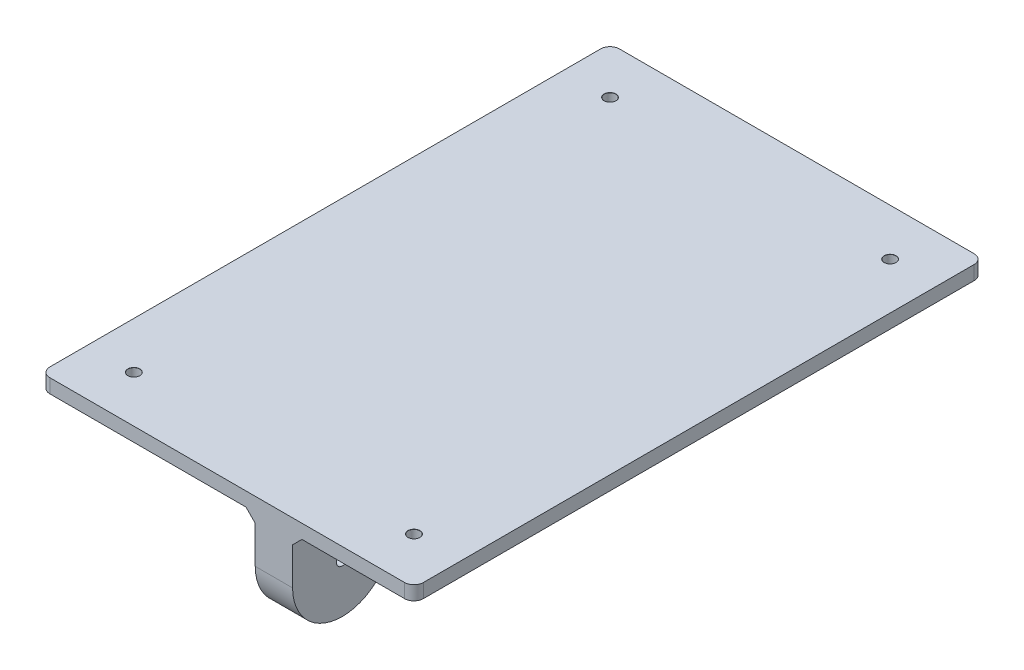
ISO-10303-21;
HEADER;
FILE_DESCRIPTION(('STEP AP214'),'2;1');
FILE_NAME('part.step','',(''),(''),'','','');
FILE_SCHEMA(('AUTOMOTIVE_DESIGN { 1 0 10303 214 1 1 1 1 }'));
ENDSEC;
DATA;
#1=APPLICATION_CONTEXT('core data for automotive mechanical design processes');
#2=APPLICATION_PROTOCOL_DEFINITION('international standard','automotive_design',2000,#1);
#3=PRODUCT_CONTEXT('',#1,'mechanical');
#4=PRODUCT('Part','Part','',(#3));
#5=PRODUCT_RELATED_PRODUCT_CATEGORY('part','',(#4));
#6=PRODUCT_DEFINITION_FORMATION('','',#4);
#7=PRODUCT_DEFINITION_CONTEXT('part definition',#1,'design');
#8=PRODUCT_DEFINITION('design','',#6,#7);
#9=PRODUCT_DEFINITION_SHAPE('','',#8);
#10=(LENGTH_UNIT() NAMED_UNIT(*) SI_UNIT(.MILLI.,.METRE.));
#11=(NAMED_UNIT(*) PLANE_ANGLE_UNIT() SI_UNIT($,.RADIAN.));
#12=(NAMED_UNIT(*) SI_UNIT($,.STERADIAN.) SOLID_ANGLE_UNIT());
#13=UNCERTAINTY_MEASURE_WITH_UNIT(LENGTH_MEASURE(1.E-05),#10,'distance_accuracy_value','');
#14=(GEOMETRIC_REPRESENTATION_CONTEXT(3) GLOBAL_UNCERTAINTY_ASSIGNED_CONTEXT((#13)) GLOBAL_UNIT_ASSIGNED_CONTEXT((#10,
#11,#12)) REPRESENTATION_CONTEXT('',''));
#15=CARTESIAN_POINT('',(0.,0.,0.));
#16=DIRECTION('',(0.,0.,1.));
#17=DIRECTION('',(1.,0.,0.));
#18=AXIS2_PLACEMENT_3D('',#15,#16,#17);
#19=CARTESIAN_POINT('',(0.,0.,0.));
#20=DIRECTION('',(0.,-1.,0.));
#21=DIRECTION('',(0.,0.,-1.));
#22=AXIS2_PLACEMENT_3D('',#19,#20,#21);
#23=PLANE('',#22);
#24=CARTESIAN_POINT('',(-30.,0.,-51.));
#25=DIRECTION('',(0.,-1.,0.));
#26=DIRECTION('',(0.,0.,-1.));
#27=AXIS2_PLACEMENT_3D('',#24,#25,#26);
#28=CIRCLE('',#27,1.24999999999999);
#29=CARTESIAN_POINT('',(-30.,0.,-52.25));
#30=VERTEX_POINT('',#29);
#31=EDGE_CURVE('E414',#30,#30,#28,.T.);
#32=ORIENTED_EDGE('',*,*,#31,.F.);
#33=EDGE_LOOP('',(#32));
#34=FACE_BOUND('',#33,.T.);
#35=CARTESIAN_POINT('',(-30.,0.,51.));
#36=DIRECTION('',(0.,-1.,0.));
#37=DIRECTION('',(0.,0.,-1.));
#38=AXIS2_PLACEMENT_3D('',#35,#36,#37);
#39=CIRCLE('',#38,1.24999999999999);
#40=CARTESIAN_POINT('',(-30.,0.,49.75));
#41=VERTEX_POINT('',#40);
#42=EDGE_CURVE('E408',#41,#41,#39,.T.);
#43=ORIENTED_EDGE('',*,*,#42,.F.);
#44=EDGE_LOOP('',(#43));
#45=FACE_BOUND('',#44,.T.);
#46=CARTESIAN_POINT('',(30.,0.,51.));
#47=DIRECTION('',(0.,-1.,0.));
#48=DIRECTION('',(0.,0.,-1.));
#49=AXIS2_PLACEMENT_3D('',#46,#47,#48);
#50=CIRCLE('',#49,1.24999999999999);
#51=CARTESIAN_POINT('',(30.,0.,49.75));
#52=VERTEX_POINT('',#51);
#53=EDGE_CURVE('E402',#52,#52,#50,.T.);
#54=ORIENTED_EDGE('',*,*,#53,.F.);
#55=EDGE_LOOP('',(#54));
#56=FACE_BOUND('',#55,.T.);
#57=CARTESIAN_POINT('',(30.,0.,-51.));
#58=DIRECTION('',(0.,-1.,0.));
#59=DIRECTION('',(0.,0.,-1.));
#60=AXIS2_PLACEMENT_3D('',#57,#58,#59);
#61=CIRCLE('',#60,1.24999999999999);
#62=CARTESIAN_POINT('',(30.,0.,-52.25));
#63=VERTEX_POINT('',#62);
#64=EDGE_CURVE('E349',#63,#63,#61,.T.);
#65=ORIENTED_EDGE('',*,*,#64,.F.);
#66=EDGE_LOOP('',(#65));
#67=FACE_BOUND('',#66,.T.);
#68=DIRECTION('',(-1.,0.,0.));
#69=VECTOR('',#68,1.);
#70=CARTESIAN_POINT('',(-40.,0.,-61.));
#71=LINE('',#70,#69);
#72=CARTESIAN_POINT('',(38.,0.,-61.));
#73=VERTEX_POINT('',#72);
#74=CARTESIAN_POINT('',(16.,0.,-61.));
#75=VERTEX_POINT('',#74);
#76=EDGE_CURVE('E276',#73,#75,#71,.T.);
#77=ORIENTED_EDGE('',*,*,#76,.F.);
#78=CARTESIAN_POINT('',(38.,0.,-59.));
#79=DIRECTION('',(0.,-1.,0.));
#80=DIRECTION('',(0.,0.,-1.));
#81=AXIS2_PLACEMENT_3D('',#78,#79,#80);
#82=CIRCLE('',#81,2.);
#83=CARTESIAN_POINT('',(40.,0.,-59.));
#84=VERTEX_POINT('',#83);
#85=EDGE_CURVE('E368',#73,#84,#82,.T.);
#86=ORIENTED_EDGE('',*,*,#85,.T.);
#87=DIRECTION('',(0.,0.,-1.));
#88=VECTOR('',#87,1.);
#89=CARTESIAN_POINT('',(40.,0.,61.));
#90=LINE('',#89,#88);
#91=CARTESIAN_POINT('',(40.,0.,59.));
#92=VERTEX_POINT('',#91);
#93=EDGE_CURVE('E255',#92,#84,#90,.T.);
#94=ORIENTED_EDGE('',*,*,#93,.F.);
#95=CARTESIAN_POINT('',(38.,0.,59.));
#96=DIRECTION('',(0.,-1.,0.));
#97=DIRECTION('',(0.,0.,-1.));
#98=AXIS2_PLACEMENT_3D('',#95,#96,#97);
#99=CIRCLE('',#98,2.);
#100=CARTESIAN_POINT('',(38.,0.,61.));
#101=VERTEX_POINT('',#100);
#102=EDGE_CURVE('E365',#92,#101,#99,.T.);
#103=ORIENTED_EDGE('',*,*,#102,.T.);
#104=DIRECTION('',(1.,0.,0.));
#105=VECTOR('',#104,1.);
#106=CARTESIAN_POINT('',(-40.,0.,61.));
#107=LINE('',#106,#105);
#108=CARTESIAN_POINT('',(16.,0.,61.));
#109=VERTEX_POINT('',#108);
#110=EDGE_CURVE('E283',#109,#101,#107,.T.);
#111=ORIENTED_EDGE('',*,*,#110,.F.);
#112=DIRECTION('',(0.,0.,-1.));
#113=VECTOR('',#112,1.);
#114=CARTESIAN_POINT('',(16.,0.,39.72));
#115=LINE('',#114,#113);
#116=CARTESIAN_POINT('',(16.,0.,37.72));
#117=VERTEX_POINT('',#116);
#118=EDGE_CURVE('E296',#109,#117,#115,.T.);
#119=ORIENTED_EDGE('',*,*,#118,.T.);
#120=DIRECTION('',(-1.,0.,0.));
#121=VECTOR('',#120,1.);
#122=CARTESIAN_POINT('',(0.,0.,37.72));
#123=LINE('',#122,#121);
#124=CARTESIAN_POINT('',(4.00000000000001,0.,37.72));
#125=VERTEX_POINT('',#124);
#126=EDGE_CURVE('E299',#117,#125,#123,.T.);
#127=ORIENTED_EDGE('',*,*,#126,.T.);
#128=DIRECTION('',(0.,0.,1.));
#129=VECTOR('',#128,1.);
#130=CARTESIAN_POINT('',(4.00000000000001,0.,0.));
#131=LINE('',#130,#129);
#132=CARTESIAN_POINT('',(4.00000000000001,0.,61.));
#133=VERTEX_POINT('',#132);
#134=EDGE_CURVE('E302',#125,#133,#131,.T.);
#135=ORIENTED_EDGE('',*,*,#134,.T.);
#136=CARTESIAN_POINT('',(-38.,0.,61.));
#137=VERTEX_POINT('',#136);
#138=EDGE_CURVE('E261',#137,#133,#107,.T.);
#139=ORIENTED_EDGE('',*,*,#138,.F.);
#140=CARTESIAN_POINT('',(-38.,0.,59.));
#141=DIRECTION('',(0.,-1.,0.));
#142=DIRECTION('',(0.,0.,-1.));
#143=AXIS2_PLACEMENT_3D('',#140,#141,#142);
#144=CIRCLE('',#143,2.);
#145=CARTESIAN_POINT('',(-40.,0.,59.));
#146=VERTEX_POINT('',#145);
#147=EDGE_CURVE('E362',#137,#146,#144,.T.);
#148=ORIENTED_EDGE('',*,*,#147,.T.);
#149=DIRECTION('',(0.,0.,1.));
#150=VECTOR('',#149,1.);
#151=CARTESIAN_POINT('',(-40.,0.,61.));
#152=LINE('',#151,#150);
#153=CARTESIAN_POINT('',(-40.,0.,-59.));
#154=VERTEX_POINT('',#153);
#155=EDGE_CURVE('E279',#154,#146,#152,.T.);
#156=ORIENTED_EDGE('',*,*,#155,.F.);
#157=CARTESIAN_POINT('',(-38.,0.,-59.));
#158=DIRECTION('',(0.,-1.,0.));
#159=DIRECTION('',(0.,0.,-1.));
#160=AXIS2_PLACEMENT_3D('',#157,#158,#159);
#161=CIRCLE('',#160,2.);
#162=CARTESIAN_POINT('',(-38.,0.,-61.));
#163=VERTEX_POINT('',#162);
#164=EDGE_CURVE('E359',#154,#163,#161,.T.);
#165=ORIENTED_EDGE('',*,*,#164,.T.);
#166=CARTESIAN_POINT('',(4.,0.,-61.));
#167=VERTEX_POINT('',#166);
#168=EDGE_CURVE('E275',#167,#163,#71,.T.);
#169=ORIENTED_EDGE('',*,*,#168,.F.);
#170=DIRECTION('',(0.,0.,1.));
#171=VECTOR('',#170,1.);
#172=CARTESIAN_POINT('',(4.,0.,0.));
#173=LINE('',#172,#171);
#174=CARTESIAN_POINT('',(4.,0.,-37.72));
#175=VERTEX_POINT('',#174);
#176=EDGE_CURVE('E292',#167,#175,#173,.T.);
#177=ORIENTED_EDGE('',*,*,#176,.T.);
#178=DIRECTION('',(1.,0.,0.));
#179=VECTOR('',#178,1.);
#180=CARTESIAN_POINT('',(0.,0.,-37.72));
#181=LINE('',#180,#179);
#182=CARTESIAN_POINT('',(16.,0.,-37.72));
#183=VERTEX_POINT('',#182);
#184=EDGE_CURVE('E289',#175,#183,#181,.T.);
#185=ORIENTED_EDGE('',*,*,#184,.T.);
#186=DIRECTION('',(0.,0.,-1.));
#187=VECTOR('',#186,1.);
#188=CARTESIAN_POINT('',(16.,0.,-61.));
#189=LINE('',#188,#187);
#190=EDGE_CURVE('E271',#183,#75,#189,.T.);
#191=ORIENTED_EDGE('',*,*,#190,.T.);
#192=EDGE_LOOP('',(#77,#86,#94,#103,#111,#119,#127,#135,#139,#148,#156,#165,#169,#177,#185,#191));
#193=FACE_BOUND('',#192,.T.);
#194=ADVANCED_FACE('F44',(#34,#45,#56,#67,#193),#23,.T.);
#195=CARTESIAN_POINT('',(40.,3.,61.));
#196=DIRECTION('',(-1.,0.,0.));
#197=DIRECTION('',(0.,0.,1.));
#198=AXIS2_PLACEMENT_3D('',#195,#196,#197);
#199=PLANE('',#198);
#200=ORIENTED_EDGE('',*,*,#93,.T.);
#201=DIRECTION('',(0.,-1.,0.));
#202=VECTOR('',#201,1.);
#203=CARTESIAN_POINT('',(40.,3.,-59.));
#204=LINE('',#203,#202);
#205=CARTESIAN_POINT('',(40.,3.,-59.));
#206=VERTEX_POINT('',#205);
#207=EDGE_CURVE('E375',#84,#206,#204,.F.);
#208=ORIENTED_EDGE('',*,*,#207,.T.);
#209=DIRECTION('',(0.,0.,-1.));
#210=VECTOR('',#209,1.);
#211=CARTESIAN_POINT('',(40.,3.,61.));
#212=LINE('',#211,#210);
#213=CARTESIAN_POINT('',(40.,3.,59.));
#214=VERTEX_POINT('',#213);
#215=EDGE_CURVE('E256',#214,#206,#212,.T.);
#216=ORIENTED_EDGE('',*,*,#215,.F.);
#217=DIRECTION('',(0.,-1.,0.));
#218=VECTOR('',#217,1.);
#219=CARTESIAN_POINT('',(40.,3.,59.));
#220=LINE('',#219,#218);
#221=EDGE_CURVE('E371',#214,#92,#220,.T.);
#222=ORIENTED_EDGE('',*,*,#221,.T.);
#223=EDGE_LOOP('',(#200,#208,#216,#222));
#224=FACE_BOUND('',#223,.T.);
#225=ADVANCED_FACE('F550',(#224),#199,.F.);
#226=CARTESIAN_POINT('',(-40.,3.,-61.));
#227=DIRECTION('',(0.,0.,1.));
#228=DIRECTION('',(1.,0.,0.));
#229=AXIS2_PLACEMENT_3D('',#226,#227,#228);
#230=PLANE('',#229);
#231=DIRECTION('',(-1.,0.,0.));
#232=VECTOR('',#231,1.);
#233=CARTESIAN_POINT('',(-40.,3.,-61.));
#234=LINE('',#233,#232);
#235=CARTESIAN_POINT('',(38.,3.,-61.));
#236=VERTEX_POINT('',#235);
#237=CARTESIAN_POINT('',(-38.,3.,-61.));
#238=VERTEX_POINT('',#237);
#239=EDGE_CURVE('E260',#236,#238,#234,.T.);
#240=ORIENTED_EDGE('',*,*,#239,.F.);
#241=DIRECTION('',(0.,-1.,0.));
#242=VECTOR('',#241,1.);
#243=CARTESIAN_POINT('',(38.,3.,-61.));
#244=LINE('',#243,#242);
#245=EDGE_CURVE('E355',#236,#73,#244,.T.);
#246=ORIENTED_EDGE('',*,*,#245,.T.);
#247=ORIENTED_EDGE('',*,*,#76,.T.);
#248=DIRECTION('',(0.707106781186545,0.70710678118655,0.));
#249=VECTOR('',#248,1.);
#250=CARTESIAN_POINT('',(-10.4999999999998,-26.5,-61.));
#251=LINE('',#250,#249);
#252=CARTESIAN_POINT('',(14.,-2.00000000000002,-61.));
#253=VERTEX_POINT('',#252);
#254=EDGE_CURVE('E332',#75,#253,#251,.F.);
#255=ORIENTED_EDGE('',*,*,#254,.T.);
#256=DIRECTION('',(0.,1.,0.));
#257=VECTOR('',#256,1.);
#258=CARTESIAN_POINT('',(14.,0.,-61.));
#259=LINE('',#258,#257);
#260=CARTESIAN_POINT('',(14.,-10.,-61.));
#261=VERTEX_POINT('',#260);
#262=EDGE_CURVE('E207',#261,#253,#259,.T.);
#263=ORIENTED_EDGE('',*,*,#262,.F.);
#264=DIRECTION('',(-1.,0.,0.));
#265=VECTOR('',#264,1.);
#266=CARTESIAN_POINT('',(14.,-10.,-61.));
#267=LINE('',#266,#265);
#268=CARTESIAN_POINT('',(6.,-10.,-61.));
#269=VERTEX_POINT('',#268);
#270=EDGE_CURVE('E190',#261,#269,#267,.T.);
#271=ORIENTED_EDGE('',*,*,#270,.T.);
#272=DIRECTION('',(0.,1.,0.));
#273=VECTOR('',#272,1.);
#274=CARTESIAN_POINT('',(6.,0.,-61.));
#275=LINE('',#274,#273);
#276=CARTESIAN_POINT('',(6.,-2.00000000000002,-61.));
#277=VERTEX_POINT('',#276);
#278=EDGE_CURVE('E199',#269,#277,#275,.T.);
#279=ORIENTED_EDGE('',*,*,#278,.T.);
#280=DIRECTION('',(-0.707106781186545,0.70710678118655,0.));
#281=VECTOR('',#280,1.);
#282=CARTESIAN_POINT('',(-19.4999999999999,23.5,-61.));
#283=LINE('',#282,#281);
#284=EDGE_CURVE('E329',#277,#167,#283,.T.);
#285=ORIENTED_EDGE('',*,*,#284,.T.);
#286=ORIENTED_EDGE('',*,*,#168,.T.);
#287=DIRECTION('',(0.,-1.,0.));
#288=VECTOR('',#287,1.);
#289=CARTESIAN_POINT('',(-38.,3.,-61.));
#290=LINE('',#289,#288);
#291=EDGE_CURVE('E335',#163,#238,#290,.F.);
#292=ORIENTED_EDGE('',*,*,#291,.T.);
#293=EDGE_LOOP('',(#240,#246,#247,#255,#263,#271,#279,#285,#286,#292));
#294=FACE_BOUND('',#293,.T.);
#295=ADVANCED_FACE('F204',(#294),#230,.F.);
#296=CARTESIAN_POINT('',(-40.,3.,61.));
#297=DIRECTION('',(1.,0.,0.));
#298=DIRECTION('',(0.,0.,-1.));
#299=AXIS2_PLACEMENT_3D('',#296,#297,#298);
#300=PLANE('',#299);
#301=ORIENTED_EDGE('',*,*,#155,.T.);
#302=DIRECTION('',(0.,-1.,0.));
#303=VECTOR('',#302,1.);
#304=CARTESIAN_POINT('',(-40.,3.,59.));
#305=LINE('',#304,#303);
#306=CARTESIAN_POINT('',(-40.,3.,59.));
#307=VERTEX_POINT('',#306);
#308=EDGE_CURVE('E11',#146,#307,#305,.F.);
#309=ORIENTED_EDGE('',*,*,#308,.T.);
#310=DIRECTION('',(0.,0.,1.));
#311=VECTOR('',#310,1.);
#312=CARTESIAN_POINT('',(-40.,3.,61.));
#313=LINE('',#312,#311);
#314=CARTESIAN_POINT('',(-40.,3.,-59.));
#315=VERTEX_POINT('',#314);
#316=EDGE_CURVE('E265',#315,#307,#313,.T.);
#317=ORIENTED_EDGE('',*,*,#316,.F.);
#318=DIRECTION('',(0.,-1.,0.));
#319=VECTOR('',#318,1.);
#320=CARTESIAN_POINT('',(-40.,3.,-59.));
#321=LINE('',#320,#319);
#322=EDGE_CURVE('E54',#315,#154,#321,.T.);
#323=ORIENTED_EDGE('',*,*,#322,.T.);
#324=EDGE_LOOP('',(#301,#309,#317,#323));
#325=FACE_BOUND('',#324,.T.);
#326=ADVANCED_FACE('F537',(#325),#300,.F.);
#327=CARTESIAN_POINT('',(-40.,3.,61.));
#328=DIRECTION('',(0.,0.,-1.));
#329=DIRECTION('',(-1.,0.,0.));
#330=AXIS2_PLACEMENT_3D('',#327,#328,#329);
#331=PLANE('',#330);
#332=ORIENTED_EDGE('',*,*,#110,.T.);
#333=DIRECTION('',(0.,-1.,0.));
#334=VECTOR('',#333,1.);
#335=CARTESIAN_POINT('',(38.,3.,61.));
#336=LINE('',#335,#334);
#337=CARTESIAN_POINT('',(38.,3.,61.));
#338=VERTEX_POINT('',#337);
#339=EDGE_CURVE('E62',#101,#338,#336,.F.);
#340=ORIENTED_EDGE('',*,*,#339,.T.);
#341=DIRECTION('',(1.,0.,0.));
#342=VECTOR('',#341,1.);
#343=CARTESIAN_POINT('',(-40.,3.,61.));
#344=LINE('',#343,#342);
#345=CARTESIAN_POINT('',(-38.,3.,61.));
#346=VERTEX_POINT('',#345);
#347=EDGE_CURVE('E268',#346,#338,#344,.T.);
#348=ORIENTED_EDGE('',*,*,#347,.F.);
#349=DIRECTION('',(0.,-1.,0.));
#350=VECTOR('',#349,1.);
#351=CARTESIAN_POINT('',(-38.,3.,61.));
#352=LINE('',#351,#350);
#353=EDGE_CURVE('E389',#346,#137,#352,.T.);
#354=ORIENTED_EDGE('',*,*,#353,.T.);
#355=ORIENTED_EDGE('',*,*,#138,.T.);
#356=DIRECTION('',(0.707106781186545,-0.70710678118655,0.));
#357=VECTOR('',#356,1.);
#358=CARTESIAN_POINT('',(-19.4999999999998,23.5,61.));
#359=LINE('',#358,#357);
#360=CARTESIAN_POINT('',(6.,-2.,61.));
#361=VERTEX_POINT('',#360);
#362=EDGE_CURVE('E323',#133,#361,#359,.T.);
#363=ORIENTED_EDGE('',*,*,#362,.T.);
#364=DIRECTION('',(0.,-1.,0.));
#365=VECTOR('',#364,1.);
#366=CARTESIAN_POINT('',(6.,0.,61.));
#367=LINE('',#366,#365);
#368=CARTESIAN_POINT('',(6.,-10.,61.));
#369=VERTEX_POINT('',#368);
#370=EDGE_CURVE('E223',#361,#369,#367,.T.);
#371=ORIENTED_EDGE('',*,*,#370,.T.);
#372=DIRECTION('',(-1.,0.,0.));
#373=VECTOR('',#372,1.);
#374=CARTESIAN_POINT('',(14.,-10.,61.));
#375=LINE('',#374,#373);
#376=CARTESIAN_POINT('',(14.,-10.,61.));
#377=VERTEX_POINT('',#376);
#378=EDGE_CURVE('E251',#377,#369,#375,.T.);
#379=ORIENTED_EDGE('',*,*,#378,.F.);
#380=DIRECTION('',(0.,-1.,0.));
#381=VECTOR('',#380,1.);
#382=CARTESIAN_POINT('',(14.,0.,61.));
#383=LINE('',#382,#381);
#384=CARTESIAN_POINT('',(14.,-2.,61.));
#385=VERTEX_POINT('',#384);
#386=EDGE_CURVE('E228',#385,#377,#383,.T.);
#387=ORIENTED_EDGE('',*,*,#386,.F.);
#388=DIRECTION('',(-0.707106781186545,-0.70710678118655,0.));
#389=VECTOR('',#388,1.);
#390=CARTESIAN_POINT('',(-10.4999999999998,-26.5,61.));
#391=LINE('',#390,#389);
#392=EDGE_CURVE('E326',#385,#109,#391,.F.);
#393=ORIENTED_EDGE('',*,*,#392,.T.);
#394=EDGE_LOOP('',(#332,#340,#348,#354,#355,#363,#371,#379,#387,#393));
#395=FACE_BOUND('',#394,.T.);
#396=ADVANCED_FACE('F521',(#395),#331,.F.);
#397=CARTESIAN_POINT('',(0.,3.,0.));
#398=DIRECTION('',(0.,-1.,0.));
#399=DIRECTION('',(0.,0.,-1.));
#400=AXIS2_PLACEMENT_3D('',#397,#398,#399);
#401=PLANE('',#400);
#402=CARTESIAN_POINT('',(-30.,3.,-51.));
#403=DIRECTION('',(0.,1.,0.));
#404=DIRECTION('',(0.,0.,1.));
#405=AXIS2_PLACEMENT_3D('',#402,#403,#404);
#406=CIRCLE('',#405,1.275);
#407=CARTESIAN_POINT('',(-30.,3.,-49.725));
#408=VERTEX_POINT('',#407);
#409=EDGE_CURVE('E422',#408,#408,#406,.T.);
#410=ORIENTED_EDGE('',*,*,#409,.F.);
#411=EDGE_LOOP('',(#410));
#412=FACE_BOUND('',#411,.T.);
#413=CARTESIAN_POINT('',(-30.,3.,51.));
#414=DIRECTION('',(0.,1.,0.));
#415=DIRECTION('',(0.,0.,1.));
#416=AXIS2_PLACEMENT_3D('',#413,#414,#415);
#417=CIRCLE('',#416,1.275);
#418=CARTESIAN_POINT('',(-30.,3.,52.275));
#419=VERTEX_POINT('',#418);
#420=EDGE_CURVE('E417',#419,#419,#417,.T.);
#421=ORIENTED_EDGE('',*,*,#420,.F.);
#422=EDGE_LOOP('',(#421));
#423=FACE_BOUND('',#422,.T.);
#424=CARTESIAN_POINT('',(30.,3.,51.));
#425=DIRECTION('',(0.,1.,0.));
#426=DIRECTION('',(0.,0.,1.));
#427=AXIS2_PLACEMENT_3D('',#424,#425,#426);
#428=CIRCLE('',#427,1.275);
#429=CARTESIAN_POINT('',(30.,3.,52.275));
#430=VERTEX_POINT('',#429);
#431=EDGE_CURVE('E412',#430,#430,#428,.T.);
#432=ORIENTED_EDGE('',*,*,#431,.F.);
#433=EDGE_LOOP('',(#432));
#434=FACE_BOUND('',#433,.T.);
#435=CARTESIAN_POINT('',(30.,3.,-51.));
#436=DIRECTION('',(0.,1.,0.));
#437=DIRECTION('',(0.,0.,1.));
#438=AXIS2_PLACEMENT_3D('',#435,#436,#437);
#439=CIRCLE('',#438,1.275);
#440=CARTESIAN_POINT('',(30.,3.,-49.725));
#441=VERTEX_POINT('',#440);
#442=EDGE_CURVE('E406',#441,#441,#439,.T.);
#443=ORIENTED_EDGE('',*,*,#442,.F.);
#444=EDGE_LOOP('',(#443));
#445=FACE_BOUND('',#444,.T.);
#446=ORIENTED_EDGE('',*,*,#215,.T.);
#447=CARTESIAN_POINT('',(38.,3.,-59.));
#448=DIRECTION('',(0.,-1.,0.));
#449=DIRECTION('',(0.,0.,-1.));
#450=AXIS2_PLACEMENT_3D('',#447,#448,#449);
#451=CIRCLE('',#450,2.);
#452=EDGE_CURVE('E386',#206,#236,#451,.F.);
#453=ORIENTED_EDGE('',*,*,#452,.T.);
#454=ORIENTED_EDGE('',*,*,#239,.T.);
#455=CARTESIAN_POINT('',(-38.,3.,-59.));
#456=DIRECTION('',(0.,-1.,0.));
#457=DIRECTION('',(0.,0.,-1.));
#458=AXIS2_PLACEMENT_3D('',#455,#456,#457);
#459=CIRCLE('',#458,2.);
#460=EDGE_CURVE('E378',#238,#315,#459,.F.);
#461=ORIENTED_EDGE('',*,*,#460,.T.);
#462=ORIENTED_EDGE('',*,*,#316,.T.);
#463=CARTESIAN_POINT('',(-38.,3.,59.));
#464=DIRECTION('',(0.,-1.,0.));
#465=DIRECTION('',(0.,0.,-1.));
#466=AXIS2_PLACEMENT_3D('',#463,#464,#465);
#467=CIRCLE('',#466,2.);
#468=EDGE_CURVE('E69',#307,#346,#467,.F.);
#469=ORIENTED_EDGE('',*,*,#468,.T.);
#470=ORIENTED_EDGE('',*,*,#347,.T.);
#471=CARTESIAN_POINT('',(38.,3.,59.));
#472=DIRECTION('',(0.,-1.,0.));
#473=DIRECTION('',(0.,0.,-1.));
#474=AXIS2_PLACEMENT_3D('',#471,#472,#473);
#475=CIRCLE('',#474,2.);
#476=EDGE_CURVE('E383',#338,#214,#475,.F.);
#477=ORIENTED_EDGE('',*,*,#476,.T.);
#478=EDGE_LOOP('',(#446,#453,#454,#461,#462,#469,#470,#477));
#479=FACE_BOUND('',#478,.T.);
#480=ADVANCED_FACE('F535',(#412,#423,#434,#445,#479),#401,.F.);
#481=CARTESIAN_POINT('',(14.,-10.,50.36));
#482=DIRECTION('',(-1.,0.,0.));
#483=DIRECTION('',(0.,0.,1.));
#484=AXIS2_PLACEMENT_3D('',#481,#482,#483);
#485=CYLINDRICAL_SURFACE('',#484,10.64);
#486=CARTESIAN_POINT('',(6.,-10.,50.36));
#487=DIRECTION('',(1.,0.,0.));
#488=DIRECTION('',(0.,0.,-1.));
#489=AXIS2_PLACEMENT_3D('',#486,#487,#488);
#490=CIRCLE('',#489,10.64);
#491=CARTESIAN_POINT('',(6.,-10.,39.72));
#492=VERTEX_POINT('',#491);
#493=EDGE_CURVE('E242',#369,#492,#490,.T.);
#494=ORIENTED_EDGE('',*,*,#493,.T.);
#495=DIRECTION('',(-1.,0.,0.));
#496=VECTOR('',#495,1.);
#497=CARTESIAN_POINT('',(14.,-10.,39.72));
#498=LINE('',#497,#496);
#499=CARTESIAN_POINT('',(14.,-10.,39.72));
#500=VERTEX_POINT('',#499);
#501=EDGE_CURVE('E239',#500,#492,#498,.T.);
#502=ORIENTED_EDGE('',*,*,#501,.F.);
#503=CARTESIAN_POINT('',(14.,-10.,50.36));
#504=DIRECTION('',(1.,0.,0.));
#505=DIRECTION('',(0.,0.,-1.));
#506=AXIS2_PLACEMENT_3D('',#503,#504,#505);
#507=CIRCLE('',#506,10.64);
#508=EDGE_CURVE('E231',#377,#500,#507,.T.);
#509=ORIENTED_EDGE('',*,*,#508,.F.);
#510=ORIENTED_EDGE('',*,*,#378,.T.);
#511=EDGE_LOOP('',(#494,#502,#509,#510));
#512=FACE_BOUND('',#511,.T.);
#513=ADVANCED_FACE('F670',(#512),#485,.T.);
#514=CARTESIAN_POINT('',(14.,0.,39.72));
#515=DIRECTION('',(0.,0.,1.));
#516=DIRECTION('',(1.,0.,0.));
#517=AXIS2_PLACEMENT_3D('',#514,#515,#516);
#518=PLANE('',#517);
#519=DIRECTION('',(0.,1.,0.));
#520=VECTOR('',#519,1.);
#521=CARTESIAN_POINT('',(6.,0.,39.72));
#522=LINE('',#521,#520);
#523=CARTESIAN_POINT('',(6.,-2.,39.72));
#524=VERTEX_POINT('',#523);
#525=EDGE_CURVE('E232',#492,#524,#522,.T.);
#526=ORIENTED_EDGE('',*,*,#525,.T.);
#527=DIRECTION('',(1.,0.,0.));
#528=VECTOR('',#527,1.);
#529=CARTESIAN_POINT('',(14.,-2.,39.72));
#530=LINE('',#529,#528);
#531=CARTESIAN_POINT('',(14.,-2.,39.72));
#532=VERTEX_POINT('',#531);
#533=EDGE_CURVE('E309',#524,#532,#530,.T.);
#534=ORIENTED_EDGE('',*,*,#533,.T.);
#535=DIRECTION('',(0.,1.,0.));
#536=VECTOR('',#535,1.);
#537=CARTESIAN_POINT('',(14.,0.,39.72));
#538=LINE('',#537,#536);
#539=EDGE_CURVE('E235',#500,#532,#538,.T.);
#540=ORIENTED_EDGE('',*,*,#539,.F.);
#541=ORIENTED_EDGE('',*,*,#501,.T.);
#542=EDGE_LOOP('',(#526,#534,#540,#541));
#543=FACE_BOUND('',#542,.T.);
#544=ADVANCED_FACE('F510',(#543),#518,.F.);
#545=CARTESIAN_POINT('',(14.,-10.,50.36));
#546=DIRECTION('',(1.,0.,0.));
#547=DIRECTION('',(0.,0.,-1.));
#548=AXIS2_PLACEMENT_3D('',#545,#546,#547);
#549=PLANE('',#548);
#550=CARTESIAN_POINT('',(14.,-10.,50.36));
#551=DIRECTION('',(1.,0.,0.));
#552=DIRECTION('',(0.,0.,-1.));
#553=AXIS2_PLACEMENT_3D('',#550,#551,#552);
#554=CIRCLE('',#553,1.24999999999999);
#555=CARTESIAN_POINT('',(14.,-10.,49.11));
#556=VERTEX_POINT('',#555);
#557=EDGE_CURVE('E419',#556,#556,#554,.T.);
#558=ORIENTED_EDGE('',*,*,#557,.F.);
#559=EDGE_LOOP('',(#558));
#560=FACE_BOUND('',#559,.T.);
#561=ORIENTED_EDGE('',*,*,#539,.T.);
#562=DIRECTION('',(0.,0.,1.));
#563=VECTOR('',#562,1.);
#564=CARTESIAN_POINT('',(14.,-2.,61.));
#565=LINE('',#564,#563);
#566=EDGE_CURVE('E312',#532,#385,#565,.T.);
#567=ORIENTED_EDGE('',*,*,#566,.T.);
#568=ORIENTED_EDGE('',*,*,#386,.T.);
#569=ORIENTED_EDGE('',*,*,#508,.T.);
#570=EDGE_LOOP('',(#561,#567,#568,#569));
#571=FACE_BOUND('',#570,.T.);
#572=ADVANCED_FACE('F491',(#560,#571),#549,.T.);
#573=CARTESIAN_POINT('',(6.,-10.,50.36));
#574=DIRECTION('',(1.,0.,0.));
#575=DIRECTION('',(0.,0.,-1.));
#576=AXIS2_PLACEMENT_3D('',#573,#574,#575);
#577=PLANE('',#576);
#578=CARTESIAN_POINT('',(6.,-10.,50.36));
#579=DIRECTION('',(-1.,0.,0.));
#580=DIRECTION('',(0.,0.,1.));
#581=AXIS2_PLACEMENT_3D('',#578,#579,#580);
#582=CIRCLE('',#581,6.45);
#583=CARTESIAN_POINT('',(6.,-10.,56.81));
#584=VERTEX_POINT('',#583);
#585=EDGE_CURVE('E469',#584,#584,#582,.T.);
#586=ORIENTED_EDGE('',*,*,#585,.F.);
#587=EDGE_LOOP('',(#586));
#588=FACE_BOUND('',#587,.T.);
#589=ORIENTED_EDGE('',*,*,#370,.F.);
#590=DIRECTION('',(0.,0.,-1.));
#591=VECTOR('',#590,1.);
#592=CARTESIAN_POINT('',(6.,-2.,50.36));
#593=LINE('',#592,#591);
#594=EDGE_CURVE('E306',#361,#524,#593,.T.);
#595=ORIENTED_EDGE('',*,*,#594,.T.);
#596=ORIENTED_EDGE('',*,*,#525,.F.);
#597=ORIENTED_EDGE('',*,*,#493,.F.);
#598=EDGE_LOOP('',(#589,#595,#596,#597));
#599=FACE_BOUND('',#598,.T.);
#600=ADVANCED_FACE('F487',(#588,#599),#577,.F.);
#601=CARTESIAN_POINT('',(14.,0.,-39.72));
#602=DIRECTION('',(0.,0.,-1.));
#603=DIRECTION('',(-1.,0.,0.));
#604=AXIS2_PLACEMENT_3D('',#601,#602,#603);
#605=PLANE('',#604);
#606=DIRECTION('',(0.,-1.,0.));
#607=VECTOR('',#606,1.);
#608=CARTESIAN_POINT('',(14.,0.,-39.72));
#609=LINE('',#608,#607);
#610=CARTESIAN_POINT('',(14.,-2.00000000000002,-39.72));
#611=VERTEX_POINT('',#610);
#612=CARTESIAN_POINT('',(14.,-10.,-39.72));
#613=VERTEX_POINT('',#612);
#614=EDGE_CURVE('E214',#611,#613,#609,.T.);
#615=ORIENTED_EDGE('',*,*,#614,.F.);
#616=DIRECTION('',(-1.,0.,0.));
#617=VECTOR('',#616,1.);
#618=CARTESIAN_POINT('',(14.,-2.00000000000002,-39.72));
#619=LINE('',#618,#617);
#620=CARTESIAN_POINT('',(6.,-2.00000000000002,-39.72));
#621=VERTEX_POINT('',#620);
#622=EDGE_CURVE('E317',#611,#621,#619,.T.);
#623=ORIENTED_EDGE('',*,*,#622,.T.);
#624=DIRECTION('',(0.,-1.,0.));
#625=VECTOR('',#624,1.);
#626=CARTESIAN_POINT('',(6.,0.,-39.72));
#627=LINE('',#626,#625);
#628=CARTESIAN_POINT('',(6.,-10.,-39.72));
#629=VERTEX_POINT('',#628);
#630=EDGE_CURVE('E198',#621,#629,#627,.T.);
#631=ORIENTED_EDGE('',*,*,#630,.T.);
#632=DIRECTION('',(-1.,0.,0.));
#633=VECTOR('',#632,1.);
#634=CARTESIAN_POINT('',(14.,-10.,-39.72));
#635=LINE('',#634,#633);
#636=EDGE_CURVE('E193',#613,#629,#635,.T.);
#637=ORIENTED_EDGE('',*,*,#636,.F.);
#638=EDGE_LOOP('',(#615,#623,#631,#637));
#639=FACE_BOUND('',#638,.T.);
#640=ADVANCED_FACE('F490',(#639),#605,.F.);
#641=CARTESIAN_POINT('',(14.,-10.,-50.36));
#642=DIRECTION('',(-1.,0.,0.));
#643=DIRECTION('',(0.,0.,1.));
#644=AXIS2_PLACEMENT_3D('',#641,#642,#643);
#645=CYLINDRICAL_SURFACE('',#644,10.64);
#646=CARTESIAN_POINT('',(6.,-10.,-50.36));
#647=DIRECTION('',(1.,0.,0.));
#648=DIRECTION('',(0.,0.,-1.));
#649=AXIS2_PLACEMENT_3D('',#646,#647,#648);
#650=CIRCLE('',#649,10.64);
#651=EDGE_CURVE('E186',#629,#269,#650,.T.);
#652=ORIENTED_EDGE('',*,*,#651,.T.);
#653=ORIENTED_EDGE('',*,*,#270,.F.);
#654=CARTESIAN_POINT('',(14.,-10.,-50.36));
#655=DIRECTION('',(1.,0.,0.));
#656=DIRECTION('',(0.,0.,-1.));
#657=AXIS2_PLACEMENT_3D('',#654,#655,#656);
#658=CIRCLE('',#657,10.64);
#659=EDGE_CURVE('E217',#613,#261,#658,.T.);
#660=ORIENTED_EDGE('',*,*,#659,.F.);
#661=ORIENTED_EDGE('',*,*,#636,.T.);
#662=EDGE_LOOP('',(#652,#653,#660,#661));
#663=FACE_BOUND('',#662,.T.);
#664=ADVANCED_FACE('F188',(#663),#645,.T.);
#665=CARTESIAN_POINT('',(14.,-10.,-50.36));
#666=DIRECTION('',(1.,0.,0.));
#667=DIRECTION('',(0.,0.,-1.));
#668=AXIS2_PLACEMENT_3D('',#665,#666,#667);
#669=PLANE('',#668);
#670=CARTESIAN_POINT('',(14.,-10.,-50.36));
#671=DIRECTION('',(1.,0.,0.));
#672=DIRECTION('',(0.,0.,-1.));
#673=AXIS2_PLACEMENT_3D('',#670,#671,#672);
#674=CIRCLE('',#673,1.24999999999999);
#675=CARTESIAN_POINT('',(14.,-10.,-51.61));
#676=VERTEX_POINT('',#675);
#677=EDGE_CURVE('E48',#676,#676,#674,.T.);
#678=ORIENTED_EDGE('',*,*,#677,.F.);
#679=EDGE_LOOP('',(#678));
#680=FACE_BOUND('',#679,.T.);
#681=ORIENTED_EDGE('',*,*,#262,.T.);
#682=DIRECTION('',(0.,0.,1.));
#683=VECTOR('',#682,1.);
#684=CARTESIAN_POINT('',(14.,-2.00000000000002,-39.72));
#685=LINE('',#684,#683);
#686=EDGE_CURVE('E320',#253,#611,#685,.T.);
#687=ORIENTED_EDGE('',*,*,#686,.T.);
#688=ORIENTED_EDGE('',*,*,#614,.T.);
#689=ORIENTED_EDGE('',*,*,#659,.T.);
#690=EDGE_LOOP('',(#681,#687,#688,#689));
#691=FACE_BOUND('',#690,.T.);
#692=ADVANCED_FACE('F566',(#680,#691),#669,.T.);
#693=CARTESIAN_POINT('',(6.,-10.,-50.36));
#694=DIRECTION('',(1.,0.,0.));
#695=DIRECTION('',(0.,0.,-1.));
#696=AXIS2_PLACEMENT_3D('',#693,#694,#695);
#697=PLANE('',#696);
#698=CARTESIAN_POINT('',(6.,-10.,-50.36));
#699=DIRECTION('',(-1.,0.,0.));
#700=DIRECTION('',(0.,0.,1.));
#701=AXIS2_PLACEMENT_3D('',#698,#699,#700);
#702=CIRCLE('',#701,6.45);
#703=CARTESIAN_POINT('',(6.,-10.,-43.91));
#704=VERTEX_POINT('',#703);
#705=EDGE_CURVE('E465',#704,#704,#702,.T.);
#706=ORIENTED_EDGE('',*,*,#705,.F.);
#707=EDGE_LOOP('',(#706));
#708=FACE_BOUND('',#707,.T.);
#709=ORIENTED_EDGE('',*,*,#630,.F.);
#710=DIRECTION('',(0.,0.,-1.));
#711=VECTOR('',#710,1.);
#712=CARTESIAN_POINT('',(6.,-2.00000000000002,-50.36));
#713=LINE('',#712,#711);
#714=EDGE_CURVE('E212',#621,#277,#713,.T.);
#715=ORIENTED_EDGE('',*,*,#714,.T.);
#716=ORIENTED_EDGE('',*,*,#278,.F.);
#717=ORIENTED_EDGE('',*,*,#651,.F.);
#718=EDGE_LOOP('',(#709,#715,#716,#717));
#719=FACE_BOUND('',#718,.T.);
#720=ADVANCED_FACE('F210',(#708,#719),#697,.F.);
#721=CARTESIAN_POINT('',(12.,-10.,-50.36));
#722=DIRECTION('',(-1.,0.,0.));
#723=DIRECTION('',(0.,0.,1.));
#724=AXIS2_PLACEMENT_3D('',#721,#722,#723);
#725=CYLINDRICAL_SURFACE('',#724,6.45);
#726=CARTESIAN_POINT('',(12.,-10.,-50.36));
#727=DIRECTION('',(-1.,0.,0.));
#728=DIRECTION('',(0.,0.,1.));
#729=AXIS2_PLACEMENT_3D('',#726,#727,#728);
#730=CIRCLE('',#729,6.45);
#731=CARTESIAN_POINT('',(12.,-10.,-43.91));
#732=VERTEX_POINT('',#731);
#733=EDGE_CURVE('E461',#732,#732,#730,.T.);
#734=ORIENTED_EDGE('',*,*,#733,.F.);
#735=EDGE_LOOP('',(#734));
#736=FACE_BOUND('',#735,.T.);
#737=ORIENTED_EDGE('',*,*,#705,.T.);
#738=EDGE_LOOP('',(#737));
#739=FACE_BOUND('',#738,.T.);
#740=ADVANCED_FACE('F648',(#736,#739),#725,.F.);
#741=CARTESIAN_POINT('',(12.,-10.,-50.36));
#742=DIRECTION('',(-1.,0.,0.));
#743=DIRECTION('',(0.,0.,1.));
#744=AXIS2_PLACEMENT_3D('',#741,#742,#743);
#745=PLANE('',#744);
#746=CARTESIAN_POINT('',(12.,-10.,-50.36));
#747=DIRECTION('',(-1.,0.,0.));
#748=DIRECTION('',(0.,0.,1.));
#749=AXIS2_PLACEMENT_3D('',#746,#747,#748);
#750=CIRCLE('',#749,1.275);
#751=CARTESIAN_POINT('',(12.,-10.,-49.085));
#752=VERTEX_POINT('',#751);
#753=EDGE_CURVE('E736',#752,#752,#750,.T.);
#754=ORIENTED_EDGE('',*,*,#753,.F.);
#755=EDGE_LOOP('',(#754));
#756=FACE_BOUND('',#755,.T.);
#757=ORIENTED_EDGE('',*,*,#733,.T.);
#758=EDGE_LOOP('',(#757));
#759=FACE_BOUND('',#758,.T.);
#760=ADVANCED_FACE('F483',(#756,#759),#745,.T.);
#761=CARTESIAN_POINT('',(12.,-10.,50.36));
#762=DIRECTION('',(-1.,0.,0.));
#763=DIRECTION('',(0.,0.,1.));
#764=AXIS2_PLACEMENT_3D('',#761,#762,#763);
#765=CYLINDRICAL_SURFACE('',#764,6.45);
#766=CARTESIAN_POINT('',(12.,-10.,50.36));
#767=DIRECTION('',(-1.,0.,0.));
#768=DIRECTION('',(0.,0.,1.));
#769=AXIS2_PLACEMENT_3D('',#766,#767,#768);
#770=CIRCLE('',#769,6.45);
#771=CARTESIAN_POINT('',(12.,-10.,56.81));
#772=VERTEX_POINT('',#771);
#773=EDGE_CURVE('E345',#772,#772,#770,.T.);
#774=ORIENTED_EDGE('',*,*,#773,.F.);
#775=EDGE_LOOP('',(#774));
#776=FACE_BOUND('',#775,.T.);
#777=ORIENTED_EDGE('',*,*,#585,.T.);
#778=EDGE_LOOP('',(#777));
#779=FACE_BOUND('',#778,.T.);
#780=ADVANCED_FACE('F480',(#776,#779),#765,.F.);
#781=CARTESIAN_POINT('',(12.,-10.,50.36));
#782=DIRECTION('',(-1.,0.,0.));
#783=DIRECTION('',(0.,0.,1.));
#784=AXIS2_PLACEMENT_3D('',#781,#782,#783);
#785=PLANE('',#784);
#786=CARTESIAN_POINT('',(12.,-10.,50.36));
#787=DIRECTION('',(-1.,0.,0.));
#788=DIRECTION('',(0.,0.,1.));
#789=AXIS2_PLACEMENT_3D('',#786,#787,#788);
#790=CIRCLE('',#789,1.275);
#791=CARTESIAN_POINT('',(12.,-10.,51.635));
#792=VERTEX_POINT('',#791);
#793=EDGE_CURVE('E431',#792,#792,#790,.T.);
#794=ORIENTED_EDGE('',*,*,#793,.F.);
#795=EDGE_LOOP('',(#794));
#796=FACE_BOUND('',#795,.T.);
#797=ORIENTED_EDGE('',*,*,#773,.T.);
#798=EDGE_LOOP('',(#797));
#799=FACE_BOUND('',#798,.T.);
#800=ADVANCED_FACE('F478',(#796,#799),#785,.T.);
#801=CARTESIAN_POINT('',(14.,-2.,50.36));
#802=DIRECTION('',(0.70710678118655,-0.707106781186545,0.));
#803=DIRECTION('',(0.,0.,-1.));
#804=AXIS2_PLACEMENT_3D('',#801,#802,#803);
#805=PLANE('',#804);
#806=ORIENTED_EDGE('',*,*,#392,.F.);
#807=ORIENTED_EDGE('',*,*,#566,.F.);
#808=DIRECTION('',(-0.577350269189624,-0.577350269189629,0.577350269189625));
#809=VECTOR('',#808,1.);
#810=CARTESIAN_POINT('',(10.4533333333334,-5.54666666666668,43.2666666666666));
#811=LINE('',#810,#809);
#812=EDGE_CURVE('E340',#117,#532,#811,.T.);
#813=ORIENTED_EDGE('',*,*,#812,.F.);
#814=ORIENTED_EDGE('',*,*,#118,.F.);
#815=EDGE_LOOP('',(#806,#807,#813,#814));
#816=FACE_BOUND('',#815,.T.);
#817=ADVANCED_FACE('F518',(#816),#805,.T.);
#818=CARTESIAN_POINT('',(0.,0.,37.72));
#819=DIRECTION('',(0.,0.707106781186545,0.70710678118655));
#820=DIRECTION('',(-1.,0.,0.));
#821=AXIS2_PLACEMENT_3D('',#818,#819,#820);
#822=PLANE('',#821);
#823=ORIENTED_EDGE('',*,*,#812,.T.);
#824=ORIENTED_EDGE('',*,*,#533,.F.);
#825=DIRECTION('',(-0.577350269189624,0.577350269189628,-0.577350269189624));
#826=VECTOR('',#825,1.);
#827=CARTESIAN_POINT('',(2.66666666666668,1.33333333333334,36.3866666666667));
#828=LINE('',#827,#826);
#829=EDGE_CURVE('E336',#125,#524,#828,.F.);
#830=ORIENTED_EDGE('',*,*,#829,.F.);
#831=ORIENTED_EDGE('',*,*,#126,.F.);
#832=EDGE_LOOP('',(#823,#824,#830,#831));
#833=FACE_BOUND('',#832,.T.);
#834=ADVANCED_FACE('F506',(#833),#822,.F.);
#835=CARTESIAN_POINT('',(4.00000000000001,0.,0.));
#836=DIRECTION('',(0.70710678118655,0.707106781186545,0.));
#837=DIRECTION('',(0.,0.,1.));
#838=AXIS2_PLACEMENT_3D('',#835,#836,#837);
#839=PLANE('',#838);
#840=ORIENTED_EDGE('',*,*,#829,.T.);
#841=ORIENTED_EDGE('',*,*,#594,.F.);
#842=ORIENTED_EDGE('',*,*,#362,.F.);
#843=ORIENTED_EDGE('',*,*,#134,.F.);
#844=EDGE_LOOP('',(#840,#841,#842,#843));
#845=FACE_BOUND('',#844,.T.);
#846=ADVANCED_FACE('F500',(#845),#839,.F.);
#847=CARTESIAN_POINT('',(14.,-2.00000000000002,-50.36));
#848=DIRECTION('',(0.70710678118655,-0.707106781186545,0.));
#849=DIRECTION('',(0.,0.,-1.));
#850=AXIS2_PLACEMENT_3D('',#847,#848,#849);
#851=PLANE('',#850);
#852=ORIENTED_EDGE('',*,*,#254,.F.);
#853=ORIENTED_EDGE('',*,*,#190,.F.);
#854=DIRECTION('',(0.577350269189624,0.577350269189629,0.577350269189625));
#855=VECTOR('',#854,1.);
#856=CARTESIAN_POINT('',(10.4533333333334,-5.54666666666669,-43.2666666666667));
#857=LINE('',#856,#855);
#858=EDGE_CURVE('E341',#611,#183,#857,.T.);
#859=ORIENTED_EDGE('',*,*,#858,.F.);
#860=ORIENTED_EDGE('',*,*,#686,.F.);
#861=EDGE_LOOP('',(#852,#853,#859,#860));
#862=FACE_BOUND('',#861,.T.);
#863=ADVANCED_FACE('F562',(#862),#851,.T.);
#864=CARTESIAN_POINT('',(14.,-2.00000000000002,-39.72));
#865=DIRECTION('',(0.,0.707106781186545,-0.70710678118655));
#866=DIRECTION('',(-1.,0.,0.));
#867=AXIS2_PLACEMENT_3D('',#864,#865,#866);
#868=PLANE('',#867);
#869=ORIENTED_EDGE('',*,*,#858,.T.);
#870=ORIENTED_EDGE('',*,*,#184,.F.);
#871=DIRECTION('',(0.577350269189624,-0.577350269189628,-0.577350269189624));
#872=VECTOR('',#871,1.);
#873=CARTESIAN_POINT('',(8.66666666666666,-4.66666666666669,-42.3866666666667));
#874=LINE('',#873,#872);
#875=EDGE_CURVE('E346',#621,#175,#874,.F.);
#876=ORIENTED_EDGE('',*,*,#875,.F.);
#877=ORIENTED_EDGE('',*,*,#622,.F.);
#878=EDGE_LOOP('',(#869,#870,#876,#877));
#879=FACE_BOUND('',#878,.T.);
#880=ADVANCED_FACE('F572',(#879),#868,.F.);
#881=CARTESIAN_POINT('',(4.,0.,0.));
#882=DIRECTION('',(0.70710678118655,0.707106781186545,0.));
#883=DIRECTION('',(0.,0.,1.));
#884=AXIS2_PLACEMENT_3D('',#881,#882,#883);
#885=PLANE('',#884);
#886=ORIENTED_EDGE('',*,*,#284,.F.);
#887=ORIENTED_EDGE('',*,*,#714,.F.);
#888=ORIENTED_EDGE('',*,*,#875,.T.);
#889=ORIENTED_EDGE('',*,*,#176,.F.);
#890=EDGE_LOOP('',(#886,#887,#888,#889));
#891=FACE_BOUND('',#890,.T.);
#892=ADVANCED_FACE('F570',(#891),#885,.F.);
#893=CARTESIAN_POINT('',(38.,3.,-59.));
#894=DIRECTION('',(0.,-1.,0.));
#895=DIRECTION('',(0.,0.,-1.));
#896=AXIS2_PLACEMENT_3D('',#893,#894,#895);
#897=CYLINDRICAL_SURFACE('',#896,2.);
#898=ORIENTED_EDGE('',*,*,#452,.F.);
#899=ORIENTED_EDGE('',*,*,#207,.F.);
#900=ORIENTED_EDGE('',*,*,#85,.F.);
#901=ORIENTED_EDGE('',*,*,#245,.F.);
#902=EDGE_LOOP('',(#898,#899,#900,#901));
#903=FACE_BOUND('',#902,.T.);
#904=ADVANCED_FACE('F555',(#903),#897,.T.);
#905=CARTESIAN_POINT('',(38.,3.,59.));
#906=DIRECTION('',(0.,-1.,0.));
#907=DIRECTION('',(0.,0.,-1.));
#908=AXIS2_PLACEMENT_3D('',#905,#906,#907);
#909=CYLINDRICAL_SURFACE('',#908,2.);
#910=ORIENTED_EDGE('',*,*,#476,.F.);
#911=ORIENTED_EDGE('',*,*,#339,.F.);
#912=ORIENTED_EDGE('',*,*,#102,.F.);
#913=ORIENTED_EDGE('',*,*,#221,.F.);
#914=EDGE_LOOP('',(#910,#911,#912,#913));
#915=FACE_BOUND('',#914,.T.);
#916=ADVANCED_FACE('F548',(#915),#909,.T.);
#917=CARTESIAN_POINT('',(-38.,3.,59.));
#918=DIRECTION('',(0.,-1.,0.));
#919=DIRECTION('',(0.,0.,-1.));
#920=AXIS2_PLACEMENT_3D('',#917,#918,#919);
#921=CYLINDRICAL_SURFACE('',#920,2.);
#922=ORIENTED_EDGE('',*,*,#468,.F.);
#923=ORIENTED_EDGE('',*,*,#308,.F.);
#924=ORIENTED_EDGE('',*,*,#147,.F.);
#925=ORIENTED_EDGE('',*,*,#353,.F.);
#926=EDGE_LOOP('',(#922,#923,#924,#925));
#927=FACE_BOUND('',#926,.T.);
#928=ADVANCED_FACE('F541',(#927),#921,.T.);
#929=CARTESIAN_POINT('',(-38.,3.,-59.));
#930=DIRECTION('',(0.,-1.,0.));
#931=DIRECTION('',(0.,0.,-1.));
#932=AXIS2_PLACEMENT_3D('',#929,#930,#931);
#933=CYLINDRICAL_SURFACE('',#932,2.);
#934=ORIENTED_EDGE('',*,*,#460,.F.);
#935=ORIENTED_EDGE('',*,*,#291,.F.);
#936=ORIENTED_EDGE('',*,*,#164,.F.);
#937=ORIENTED_EDGE('',*,*,#322,.F.);
#938=EDGE_LOOP('',(#934,#935,#936,#937));
#939=FACE_BOUND('',#938,.T.);
#940=ADVANCED_FACE('F46',(#939),#933,.T.);
#941=CARTESIAN_POINT('',(30.,3.,-51.));
#942=DIRECTION('',(0.,1.,0.));
#943=DIRECTION('',(0.,0.,1.));
#944=AXIS2_PLACEMENT_3D('',#941,#942,#943);
#945=CYLINDRICAL_SURFACE('',#944,1.24999999999999);
#946=ORIENTED_EDGE('',*,*,#64,.T.);
#947=EDGE_LOOP('',(#946));
#948=FACE_BOUND('',#947,.T.);
#949=CARTESIAN_POINT('',(30.,2.97500000000002,-51.));
#950=DIRECTION('',(0.,1.,0.));
#951=DIRECTION('',(0.,0.,1.));
#952=AXIS2_PLACEMENT_3D('',#949,#950,#951);
#953=CIRCLE('',#952,1.24999999999999);
#954=CARTESIAN_POINT('',(30.,2.97500000000002,-49.75));
#955=VERTEX_POINT('',#954);
#956=EDGE_CURVE('E401',#955,#955,#953,.T.);
#957=ORIENTED_EDGE('',*,*,#956,.T.);
#958=EDGE_LOOP('',(#957));
#959=FACE_BOUND('',#958,.T.);
#960=ADVANCED_FACE('F630',(#948,#959),#945,.F.);
#961=CARTESIAN_POINT('',(30.,3.,-51.));
#962=DIRECTION('',(0.,1.,0.));
#963=DIRECTION('',(0.,0.,1.));
#964=AXIS2_PLACEMENT_3D('',#961,#962,#963);
#965=CONICAL_SURFACE('',#964,1.275,0.785398163397969);
#966=ORIENTED_EDGE('',*,*,#956,.F.);
#967=EDGE_LOOP('',(#966));
#968=FACE_BOUND('',#967,.T.);
#969=ORIENTED_EDGE('',*,*,#442,.T.);
#970=EDGE_LOOP('',(#969));
#971=FACE_BOUND('',#970,.T.);
#972=ADVANCED_FACE('F634',(#968,#971),#965,.F.);
#973=CARTESIAN_POINT('',(30.,3.,51.));
#974=DIRECTION('',(0.,1.,0.));
#975=DIRECTION('',(0.,0.,1.));
#976=AXIS2_PLACEMENT_3D('',#973,#974,#975);
#977=CYLINDRICAL_SURFACE('',#976,1.24999999999999);
#978=ORIENTED_EDGE('',*,*,#53,.T.);
#979=EDGE_LOOP('',(#978));
#980=FACE_BOUND('',#979,.T.);
#981=CARTESIAN_POINT('',(30.,2.97500000000002,51.));
#982=DIRECTION('',(0.,1.,0.));
#983=DIRECTION('',(0.,0.,1.));
#984=AXIS2_PLACEMENT_3D('',#981,#982,#983);
#985=CIRCLE('',#984,1.24999999999999);
#986=CARTESIAN_POINT('',(30.,2.97500000000002,52.25));
#987=VERTEX_POINT('',#986);
#988=EDGE_CURVE('E407',#987,#987,#985,.T.);
#989=ORIENTED_EDGE('',*,*,#988,.T.);
#990=EDGE_LOOP('',(#989));
#991=FACE_BOUND('',#990,.T.);
#992=ADVANCED_FACE('F640',(#980,#991),#977,.F.);
#993=CARTESIAN_POINT('',(30.,3.,51.));
#994=DIRECTION('',(0.,1.,0.));
#995=DIRECTION('',(0.,0.,1.));
#996=AXIS2_PLACEMENT_3D('',#993,#994,#995);
#997=CONICAL_SURFACE('',#996,1.275,0.785398163397969);
#998=ORIENTED_EDGE('',*,*,#988,.F.);
#999=EDGE_LOOP('',(#998));
#1000=FACE_BOUND('',#999,.T.);
#1001=ORIENTED_EDGE('',*,*,#431,.T.);
#1002=EDGE_LOOP('',(#1001));
#1003=FACE_BOUND('',#1002,.T.);
#1004=ADVANCED_FACE('F688',(#1000,#1003),#997,.F.);
#1005=CARTESIAN_POINT('',(-30.,3.,51.));
#1006=DIRECTION('',(0.,1.,0.));
#1007=DIRECTION('',(0.,0.,1.));
#1008=AXIS2_PLACEMENT_3D('',#1005,#1006,#1007);
#1009=CYLINDRICAL_SURFACE('',#1008,1.24999999999999);
#1010=ORIENTED_EDGE('',*,*,#42,.T.);
#1011=EDGE_LOOP('',(#1010));
#1012=FACE_BOUND('',#1011,.T.);
#1013=CARTESIAN_POINT('',(-30.,2.97500000000002,51.));
#1014=DIRECTION('',(0.,1.,0.));
#1015=DIRECTION('',(0.,0.,1.));
#1016=AXIS2_PLACEMENT_3D('',#1013,#1014,#1015);
#1017=CIRCLE('',#1016,1.24999999999999);
#1018=CARTESIAN_POINT('',(-30.,2.97500000000002,52.25));
#1019=VERTEX_POINT('',#1018);
#1020=EDGE_CURVE('E413',#1019,#1019,#1017,.T.);
#1021=ORIENTED_EDGE('',*,*,#1020,.T.);
#1022=EDGE_LOOP('',(#1021));
#1023=FACE_BOUND('',#1022,.T.);
#1024=ADVANCED_FACE('F690',(#1012,#1023),#1009,.F.);
#1025=CARTESIAN_POINT('',(-30.,3.,51.));
#1026=DIRECTION('',(0.,1.,0.));
#1027=DIRECTION('',(0.,0.,1.));
#1028=AXIS2_PLACEMENT_3D('',#1025,#1026,#1027);
#1029=CONICAL_SURFACE('',#1028,1.275,0.785398163397969);
#1030=ORIENTED_EDGE('',*,*,#1020,.F.);
#1031=EDGE_LOOP('',(#1030));
#1032=FACE_BOUND('',#1031,.T.);
#1033=ORIENTED_EDGE('',*,*,#420,.T.);
#1034=EDGE_LOOP('',(#1033));
#1035=FACE_BOUND('',#1034,.T.);
#1036=ADVANCED_FACE('F697',(#1032,#1035),#1029,.F.);
#1037=CARTESIAN_POINT('',(-30.,3.,-51.));
#1038=DIRECTION('',(0.,1.,0.));
#1039=DIRECTION('',(0.,0.,1.));
#1040=AXIS2_PLACEMENT_3D('',#1037,#1038,#1039);
#1041=CYLINDRICAL_SURFACE('',#1040,1.24999999999999);
#1042=ORIENTED_EDGE('',*,*,#31,.T.);
#1043=EDGE_LOOP('',(#1042));
#1044=FACE_BOUND('',#1043,.T.);
#1045=CARTESIAN_POINT('',(-30.,2.97500000000002,-51.));
#1046=DIRECTION('',(0.,1.,0.));
#1047=DIRECTION('',(0.,0.,1.));
#1048=AXIS2_PLACEMENT_3D('',#1045,#1046,#1047);
#1049=CIRCLE('',#1048,1.24999999999999);
#1050=CARTESIAN_POINT('',(-30.,2.97500000000002,-49.75));
#1051=VERTEX_POINT('',#1050);
#1052=EDGE_CURVE('E418',#1051,#1051,#1049,.T.);
#1053=ORIENTED_EDGE('',*,*,#1052,.T.);
#1054=EDGE_LOOP('',(#1053));
#1055=FACE_BOUND('',#1054,.T.);
#1056=ADVANCED_FACE('F705',(#1044,#1055),#1041,.F.);
#1057=CARTESIAN_POINT('',(-30.,3.,-51.));
#1058=DIRECTION('',(0.,1.,0.));
#1059=DIRECTION('',(0.,0.,1.));
#1060=AXIS2_PLACEMENT_3D('',#1057,#1058,#1059);
#1061=CONICAL_SURFACE('',#1060,1.275,0.785398163397969);
#1062=ORIENTED_EDGE('',*,*,#1052,.F.);
#1063=EDGE_LOOP('',(#1062));
#1064=FACE_BOUND('',#1063,.T.);
#1065=ORIENTED_EDGE('',*,*,#409,.T.);
#1066=EDGE_LOOP('',(#1065));
#1067=FACE_BOUND('',#1066,.T.);
#1068=ADVANCED_FACE('F709',(#1064,#1067),#1061,.F.);
#1069=CARTESIAN_POINT('',(12.,-10.,50.36));
#1070=DIRECTION('',(-1.,0.,0.));
#1071=DIRECTION('',(0.,0.,1.));
#1072=AXIS2_PLACEMENT_3D('',#1069,#1070,#1071);
#1073=CYLINDRICAL_SURFACE('',#1072,1.24999999999999);
#1074=ORIENTED_EDGE('',*,*,#557,.T.);
#1075=EDGE_LOOP('',(#1074));
#1076=FACE_BOUND('',#1075,.T.);
#1077=CARTESIAN_POINT('',(12.025,-10.,50.36));
#1078=DIRECTION('',(-1.,0.,0.));
#1079=DIRECTION('',(0.,0.,1.));
#1080=AXIS2_PLACEMENT_3D('',#1077,#1078,#1079);
#1081=CIRCLE('',#1080,1.24999999999999);
#1082=CARTESIAN_POINT('',(12.025,-10.,51.61));
#1083=VERTEX_POINT('',#1082);
#1084=EDGE_CURVE('E423',#1083,#1083,#1081,.T.);
#1085=ORIENTED_EDGE('',*,*,#1084,.T.);
#1086=EDGE_LOOP('',(#1085));
#1087=FACE_BOUND('',#1086,.T.);
#1088=ADVANCED_FACE('F713',(#1076,#1087),#1073,.F.);
#1089=CARTESIAN_POINT('',(12.,-10.,50.36));
#1090=DIRECTION('',(-1.,0.,0.));
#1091=DIRECTION('',(0.,0.,1.));
#1092=AXIS2_PLACEMENT_3D('',#1089,#1090,#1091);
#1093=CONICAL_SURFACE('',#1092,1.275,0.785398163397969);
#1094=ORIENTED_EDGE('',*,*,#1084,.F.);
#1095=EDGE_LOOP('',(#1094));
#1096=FACE_BOUND('',#1095,.T.);
#1097=ORIENTED_EDGE('',*,*,#793,.T.);
#1098=EDGE_LOOP('',(#1097));
#1099=FACE_BOUND('',#1098,.T.);
#1100=ADVANCED_FACE('F717',(#1096,#1099),#1093,.F.);
#1101=CARTESIAN_POINT('',(12.,-10.,-50.36));
#1102=DIRECTION('',(-1.,0.,0.));
#1103=DIRECTION('',(0.,0.,1.));
#1104=AXIS2_PLACEMENT_3D('',#1101,#1102,#1103);
#1105=CYLINDRICAL_SURFACE('',#1104,1.24999999999999);
#1106=ORIENTED_EDGE('',*,*,#677,.T.);
#1107=EDGE_LOOP('',(#1106));
#1108=FACE_BOUND('',#1107,.T.);
#1109=CARTESIAN_POINT('',(12.025,-10.,-50.36));
#1110=DIRECTION('',(-1.,0.,0.));
#1111=DIRECTION('',(0.,0.,1.));
#1112=AXIS2_PLACEMENT_3D('',#1109,#1110,#1111);
#1113=CIRCLE('',#1112,1.24999999999999);
#1114=CARTESIAN_POINT('',(12.025,-10.,-49.11));
#1115=VERTEX_POINT('',#1114);
#1116=EDGE_CURVE('E733',#1115,#1115,#1113,.T.);
#1117=ORIENTED_EDGE('',*,*,#1116,.T.);
#1118=EDGE_LOOP('',(#1117));
#1119=FACE_BOUND('',#1118,.T.);
#1120=ADVANCED_FACE('F720',(#1108,#1119),#1105,.F.);
#1121=CARTESIAN_POINT('',(12.,-10.,-50.36));
#1122=DIRECTION('',(-1.,0.,0.));
#1123=DIRECTION('',(0.,0.,1.));
#1124=AXIS2_PLACEMENT_3D('',#1121,#1122,#1123);
#1125=CONICAL_SURFACE('',#1124,1.275,0.785398163397969);
#1126=ORIENTED_EDGE('',*,*,#1116,.F.);
#1127=EDGE_LOOP('',(#1126));
#1128=FACE_BOUND('',#1127,.T.);
#1129=ORIENTED_EDGE('',*,*,#753,.T.);
#1130=EDGE_LOOP('',(#1129));
#1131=FACE_BOUND('',#1130,.T.);
#1132=ADVANCED_FACE('F724',(#1128,#1131),#1125,.F.);
#1133=CLOSED_SHELL('',(#194,#225,#295,#326,#396,#480,#513,#544,#572,#600,#640,#664,#692,#720,
#740,#760,#780,#800,#817,#834,#846,#863,#880,#892,#904,#916,#928,#940,#960,#972,#992,#1004,
#1024,#1036,#1056,#1068,#1088,#1100,#1120,#1132));
#1134=MANIFOLD_SOLID_BREP('B2',#1133);
#1135=ADVANCED_BREP_SHAPE_REPRESENTATION('',(#18,#1134),#14);
#1136=SHAPE_DEFINITION_REPRESENTATION(#9,#1135);
ENDSEC;
END-ISO-10303-21;
